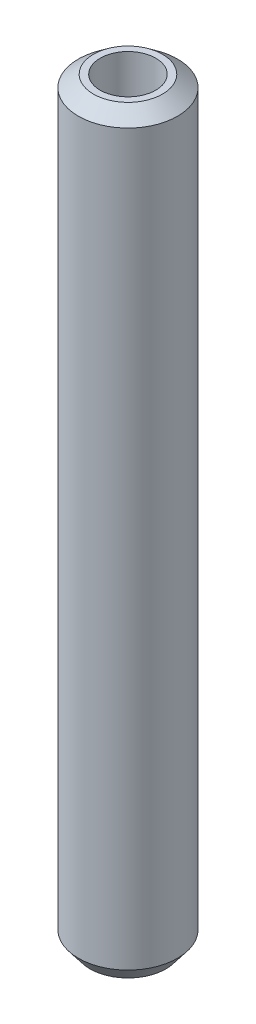
ISO-10303-21;
HEADER;
FILE_DESCRIPTION(('STEP AP214'),'2;1');
FILE_NAME('part.step','',(''),(''),'','','');
FILE_SCHEMA(('AUTOMOTIVE_DESIGN { 1 0 10303 214 1 1 1 1 }'));
ENDSEC;
DATA;
#1=APPLICATION_CONTEXT('core data for automotive mechanical design processes');
#2=APPLICATION_PROTOCOL_DEFINITION('international standard','automotive_design',2000,#1);
#3=PRODUCT_CONTEXT('',#1,'mechanical');
#4=PRODUCT('Part','Part','',(#3));
#5=PRODUCT_RELATED_PRODUCT_CATEGORY('part','',(#4));
#6=PRODUCT_DEFINITION_FORMATION('','',#4);
#7=PRODUCT_DEFINITION_CONTEXT('part definition',#1,'design');
#8=PRODUCT_DEFINITION('design','',#6,#7);
#9=PRODUCT_DEFINITION_SHAPE('','',#8);
#10=(LENGTH_UNIT() NAMED_UNIT(*) SI_UNIT(.MILLI.,.METRE.));
#11=(NAMED_UNIT(*) PLANE_ANGLE_UNIT() SI_UNIT($,.RADIAN.));
#12=(NAMED_UNIT(*) SI_UNIT($,.STERADIAN.) SOLID_ANGLE_UNIT());
#13=UNCERTAINTY_MEASURE_WITH_UNIT(LENGTH_MEASURE(1.E-05),#10,'distance_accuracy_value','');
#14=(GEOMETRIC_REPRESENTATION_CONTEXT(3) GLOBAL_UNCERTAINTY_ASSIGNED_CONTEXT((#13)) GLOBAL_UNIT_ASSIGNED_CONTEXT((#10,
#11,#12)) REPRESENTATION_CONTEXT('',''));
#15=CARTESIAN_POINT('',(0.,0.,0.));
#16=DIRECTION('',(0.,0.,1.));
#17=DIRECTION('',(1.,0.,0.));
#18=AXIS2_PLACEMENT_3D('',#15,#16,#17);
#19=CARTESIAN_POINT('',(0.,304.877717205613,0.));
#20=DIRECTION('',(0.,-1.,0.));
#21=DIRECTION('',(0.,0.,-1.));
#22=AXIS2_PLACEMENT_3D('',#19,#20,#21);
#23=CYLINDRICAL_SURFACE('',#22,20.);
#24=CARTESIAN_POINT('',(0.,300.187087167454,0.));
#25=DIRECTION('',(0.,1.,0.));
#26=DIRECTION('',(0.,0.,1.));
#27=AXIS2_PLACEMENT_3D('',#24,#25,#26);
#28=CIRCLE('',#27,20.);
#29=CARTESIAN_POINT('',(0.,300.187087167454,20.));
#30=VERTEX_POINT('',#29);
#31=EDGE_CURVE('E50',#30,#30,#28,.F.);
#32=ORIENTED_EDGE('',*,*,#31,.T.);
#33=EDGE_LOOP('',(#32));
#34=FACE_BOUND('',#33,.T.);
#35=CARTESIAN_POINT('',(0.,6.07511231940244,0.));
#36=DIRECTION('',(0.,1.,0.));
#37=DIRECTION('',(0.,0.,1.));
#38=AXIS2_PLACEMENT_3D('',#35,#36,#37);
#39=CIRCLE('',#38,20.);
#40=CARTESIAN_POINT('',(0.,6.07511231940244,20.));
#41=VERTEX_POINT('',#40);
#42=EDGE_CURVE('E51',#41,#41,#39,.T.);
#43=ORIENTED_EDGE('',*,*,#42,.T.);
#44=EDGE_LOOP('',(#43));
#45=FACE_BOUND('',#44,.T.);
#46=ADVANCED_FACE('F39',(#34,#45),#23,.T.);
#47=CARTESIAN_POINT('',(0.,304.877717205613,0.));
#48=DIRECTION('',(0.,1.,0.));
#49=DIRECTION('',(0.,0.,1.));
#50=AXIS2_PLACEMENT_3D('',#47,#48,#49);
#51=PLANE('',#50);
#52=CARTESIAN_POINT('',(0.,304.877717205613,0.));
#53=DIRECTION('',(0.,1.,0.));
#54=DIRECTION('',(0.,0.,1.));
#55=AXIS2_PLACEMENT_3D('',#52,#53,#54);
#56=CIRCLE('',#55,13.9248876805976);
#57=CARTESIAN_POINT('',(0.,304.877717205613,13.9248876805976));
#58=VERTEX_POINT('',#57);
#59=EDGE_CURVE('E54',#58,#58,#56,.T.);
#60=ORIENTED_EDGE('',*,*,#59,.T.);
#61=EDGE_LOOP('',(#60));
#62=FACE_BOUND('',#61,.T.);
#63=CARTESIAN_POINT('',(0.,304.877717205613,0.));
#64=DIRECTION('',(0.,1.,0.));
#65=DIRECTION('',(0.,0.,1.));
#66=AXIS2_PLACEMENT_3D('',#63,#64,#65);
#67=CIRCLE('',#66,11.2077455114609);
#68=CARTESIAN_POINT('',(0.,304.877717205613,11.2077455114609));
#69=VERTEX_POINT('',#68);
#70=EDGE_CURVE('E58',#69,#69,#67,.T.);
#71=ORIENTED_EDGE('',*,*,#70,.F.);
#72=EDGE_LOOP('',(#71));
#73=FACE_BOUND('',#72,.T.);
#74=ADVANCED_FACE('F69',(#62,#73),#51,.T.);
#75=CARTESIAN_POINT('',(0.,0.,0.));
#76=DIRECTION('',(0.,1.,0.));
#77=DIRECTION('',(0.,0.,1.));
#78=AXIS2_PLACEMENT_3D('',#75,#76,#77);
#79=PLANE('',#78);
#80=CARTESIAN_POINT('',(0.,0.,0.));
#81=DIRECTION('',(0.,1.,0.));
#82=DIRECTION('',(0.,0.,1.));
#83=AXIS2_PLACEMENT_3D('',#80,#81,#82);
#84=CIRCLE('',#83,15.3093699618404);
#85=CARTESIAN_POINT('',(0.,0.,15.3093699618404));
#86=VERTEX_POINT('',#85);
#87=EDGE_CURVE('E10',#86,#86,#84,.F.);
#88=ORIENTED_EDGE('',*,*,#87,.T.);
#89=EDGE_LOOP('',(#88));
#90=FACE_BOUND('',#89,.T.);
#91=CARTESIAN_POINT('',(0.,0.,0.));
#92=DIRECTION('',(0.,1.,0.));
#93=DIRECTION('',(0.,0.,1.));
#94=AXIS2_PLACEMENT_3D('',#91,#92,#93);
#95=CIRCLE('',#94,11.2077455114609);
#96=CARTESIAN_POINT('',(0.,0.,11.2077455114609));
#97=VERTEX_POINT('',#96);
#98=EDGE_CURVE('E63',#97,#97,#95,.T.);
#99=ORIENTED_EDGE('',*,*,#98,.T.);
#100=EDGE_LOOP('',(#99));
#101=FACE_BOUND('',#100,.T.);
#102=ADVANCED_FACE('F75',(#90,#101),#79,.F.);
#103=CARTESIAN_POINT('',(0.,304.877717205613,0.));
#104=DIRECTION('',(0.,-1.,0.));
#105=DIRECTION('',(0.,0.,-1.));
#106=AXIS2_PLACEMENT_3D('',#103,#104,#105);
#107=CYLINDRICAL_SURFACE('',#106,11.2077455114609);
#108=ORIENTED_EDGE('',*,*,#70,.T.);
#109=EDGE_LOOP('',(#108));
#110=FACE_BOUND('',#109,.T.);
#111=ORIENTED_EDGE('',*,*,#98,.F.);
#112=EDGE_LOOP('',(#111));
#113=FACE_BOUND('',#112,.T.);
#114=ADVANCED_FACE('F70',(#110,#113),#107,.F.);
#115=CARTESIAN_POINT('',(0.,304.877717205613,0.));
#116=DIRECTION('',(0.,-1.,0.));
#117=DIRECTION('',(0.,0.,-1.));
#118=AXIS2_PLACEMENT_3D('',#115,#116,#117);
#119=CONICAL_SURFACE('',#118,13.9248876805976,0.913296902679702);
#120=ORIENTED_EDGE('',*,*,#31,.F.);
#121=EDGE_LOOP('',(#120));
#122=FACE_BOUND('',#121,.T.);
#123=ORIENTED_EDGE('',*,*,#59,.F.);
#124=EDGE_LOOP('',(#123));
#125=FACE_BOUND('',#124,.T.);
#126=ADVANCED_FACE('F81',(#122,#125),#119,.T.);
#127=CARTESIAN_POINT('',(0.,6.07511231940244,0.));
#128=DIRECTION('',(0.,1.,0.));
#129=DIRECTION('',(0.,0.,1.));
#130=AXIS2_PLACEMENT_3D('',#127,#128,#129);
#131=CONICAL_SURFACE('',#130,20.,0.657499424115199);
#132=ORIENTED_EDGE('',*,*,#87,.F.);
#133=EDGE_LOOP('',(#132));
#134=FACE_BOUND('',#133,.T.);
#135=ORIENTED_EDGE('',*,*,#42,.F.);
#136=EDGE_LOOP('',(#135));
#137=FACE_BOUND('',#136,.T.);
#138=ADVANCED_FACE('F45',(#134,#137),#131,.T.);
#139=CLOSED_SHELL('',(#46,#74,#102,#114,#126,#138));
#140=MANIFOLD_SOLID_BREP('B2',#139);
#141=ADVANCED_BREP_SHAPE_REPRESENTATION('',(#18,#140),#14);
#142=SHAPE_DEFINITION_REPRESENTATION(#9,#141);
ENDSEC;
END-ISO-10303-21;
